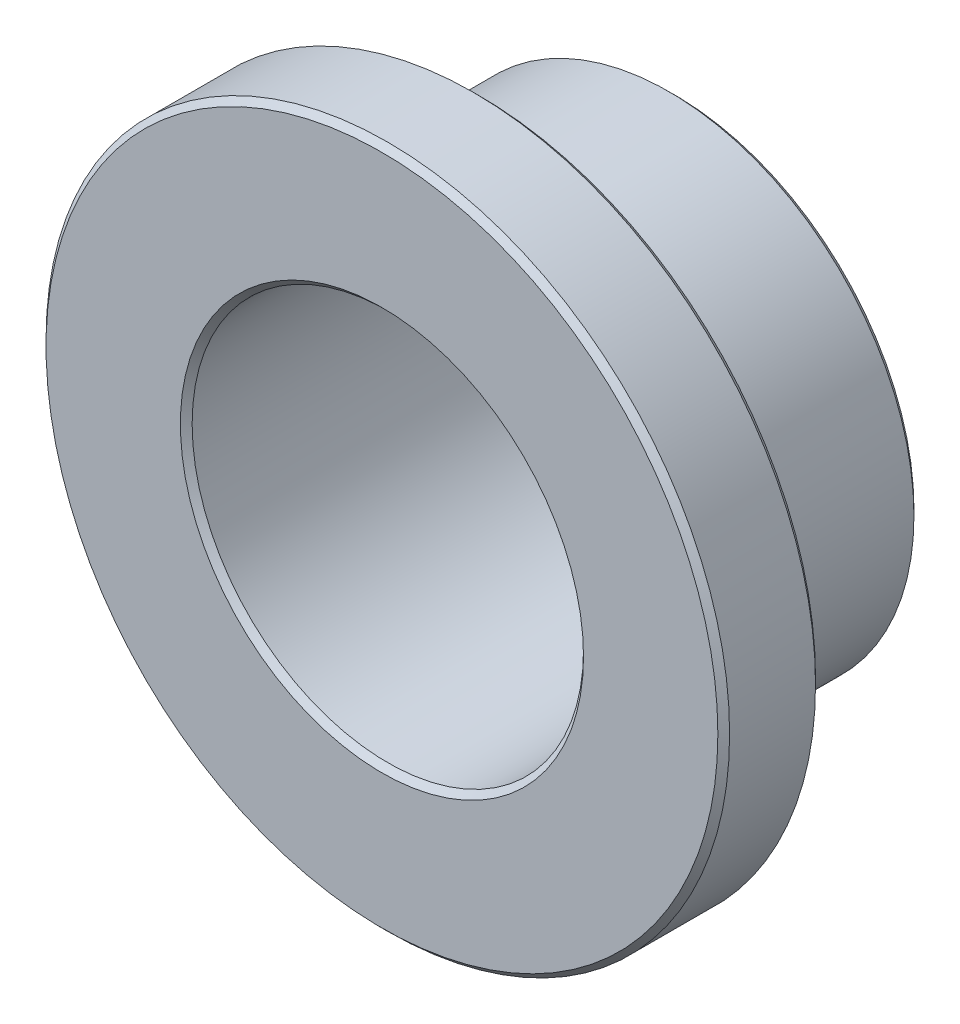
ISO-10303-21;
HEADER;
FILE_DESCRIPTION(('STEP AP214'),'2;1');
FILE_NAME('part.step','',(''),(''),'','','');
FILE_SCHEMA(('AUTOMOTIVE_DESIGN { 1 0 10303 214 1 1 1 1 }'));
ENDSEC;
DATA;
#1=APPLICATION_CONTEXT('core data for automotive mechanical design processes');
#2=APPLICATION_PROTOCOL_DEFINITION('international standard','automotive_design',2000,#1);
#3=PRODUCT_CONTEXT('',#1,'mechanical');
#4=PRODUCT('Part','Part','',(#3));
#5=PRODUCT_RELATED_PRODUCT_CATEGORY('part','',(#4));
#6=PRODUCT_DEFINITION_FORMATION('','',#4);
#7=PRODUCT_DEFINITION_CONTEXT('part definition',#1,'design');
#8=PRODUCT_DEFINITION('design','',#6,#7);
#9=PRODUCT_DEFINITION_SHAPE('','',#8);
#10=(LENGTH_UNIT() NAMED_UNIT(*) SI_UNIT(.MILLI.,.METRE.));
#11=(NAMED_UNIT(*) PLANE_ANGLE_UNIT() SI_UNIT($,.RADIAN.));
#12=(NAMED_UNIT(*) SI_UNIT($,.STERADIAN.) SOLID_ANGLE_UNIT());
#13=UNCERTAINTY_MEASURE_WITH_UNIT(LENGTH_MEASURE(1.E-05),#10,'distance_accuracy_value','');
#14=(GEOMETRIC_REPRESENTATION_CONTEXT(3) GLOBAL_UNCERTAINTY_ASSIGNED_CONTEXT((#13)) GLOBAL_UNIT_ASSIGNED_CONTEXT((#10,
#11,#12)) REPRESENTATION_CONTEXT('',''));
#15=CARTESIAN_POINT('',(0.,0.,0.));
#16=DIRECTION('',(0.,0.,1.));
#17=DIRECTION('',(1.,0.,0.));
#18=AXIS2_PLACEMENT_3D('',#15,#16,#17);
#19=CARTESIAN_POINT('',(0.,0.,1.5875));
#20=DIRECTION('',(0.,0.,1.));
#21=DIRECTION('',(1.,0.,0.));
#22=AXIS2_PLACEMENT_3D('',#19,#20,#21);
#23=CYLINDRICAL_SURFACE('',#22,11.1125);
#24=CARTESIAN_POINT('',(0.,0.,4.571619));
#25=DIRECTION('',(0.,0.,1.));
#26=DIRECTION('',(1.,0.,0.));
#27=AXIS2_PLACEMENT_3D('',#24,#25,#26);
#28=CIRCLE('',#27,11.1125);
#29=CARTESIAN_POINT('',(11.1125,0.,4.571619));
#30=VERTEX_POINT('',#29);
#31=EDGE_CURVE('E79',#30,#30,#28,.F.);
#32=ORIENTED_EDGE('',*,*,#31,.T.);
#33=EDGE_LOOP('',(#32));
#34=FACE_BOUND('',#33,.T.);
#35=CARTESIAN_POINT('',(0.,0.,1.778381));
#36=DIRECTION('',(0.,0.,1.));
#37=DIRECTION('',(1.,0.,0.));
#38=AXIS2_PLACEMENT_3D('',#35,#36,#37);
#39=CIRCLE('',#38,11.1125);
#40=CARTESIAN_POINT('',(11.1125,0.,1.778381));
#41=VERTEX_POINT('',#40);
#42=EDGE_CURVE('E83',#41,#41,#39,.T.);
#43=ORIENTED_EDGE('',*,*,#42,.T.);
#44=EDGE_LOOP('',(#43));
#45=FACE_BOUND('',#44,.T.);
#46=ADVANCED_FACE('F45',(#34,#45),#23,.T.);
#47=CARTESIAN_POINT('',(0.,0.,1.5875));
#48=DIRECTION('',(0.,0.,1.));
#49=DIRECTION('',(1.,0.,0.));
#50=AXIS2_PLACEMENT_3D('',#47,#48,#49);
#51=PLANE('',#50);
#52=CARTESIAN_POINT('',(0.,0.,1.5875));
#53=DIRECTION('',(0.,0.,1.));
#54=DIRECTION('',(1.,0.,0.));
#55=AXIS2_PLACEMENT_3D('',#52,#53,#54);
#56=CIRCLE('',#55,10.921619);
#57=CARTESIAN_POINT('',(10.921619,0.,1.5875));
#58=VERTEX_POINT('',#57);
#59=EDGE_CURVE('E71',#58,#58,#56,.F.);
#60=ORIENTED_EDGE('',*,*,#59,.T.);
#61=EDGE_LOOP('',(#60));
#62=FACE_BOUND('',#61,.T.);
#63=CARTESIAN_POINT('',(0.,0.,1.5875));
#64=DIRECTION('',(0.,0.,1.));
#65=DIRECTION('',(1.,0.,0.));
#66=AXIS2_PLACEMENT_3D('',#63,#64,#65);
#67=CIRCLE('',#66,8.153781);
#68=CARTESIAN_POINT('',(8.153781,0.,1.5875));
#69=VERTEX_POINT('',#68);
#70=EDGE_CURVE('E75',#69,#69,#67,.T.);
#71=ORIENTED_EDGE('',*,*,#70,.T.);
#72=EDGE_LOOP('',(#71));
#73=FACE_BOUND('',#72,.T.);
#74=ADVANCED_FACE('F120',(#62,#73),#51,.F.);
#75=CARTESIAN_POINT('',(0.,0.,4.7625));
#76=DIRECTION('',(0.,0.,1.));
#77=DIRECTION('',(1.,0.,0.));
#78=AXIS2_PLACEMENT_3D('',#75,#76,#77);
#79=PLANE('',#78);
#80=CARTESIAN_POINT('',(0.,0.,4.7625));
#81=DIRECTION('',(0.,0.,1.));
#82=DIRECTION('',(1.,0.,0.));
#83=AXIS2_PLACEMENT_3D('',#80,#81,#82);
#84=CIRCLE('',#83,6.55358100000001);
#85=CARTESIAN_POINT('',(6.55358100000001,0.,4.7625));
#86=VERTEX_POINT('',#85);
#87=EDGE_CURVE('E87',#86,#86,#84,.F.);
#88=ORIENTED_EDGE('',*,*,#87,.T.);
#89=EDGE_LOOP('',(#88));
#90=FACE_BOUND('',#89,.T.);
#91=CARTESIAN_POINT('',(0.,0.,4.7625));
#92=DIRECTION('',(0.,0.,1.));
#93=DIRECTION('',(1.,0.,0.));
#94=AXIS2_PLACEMENT_3D('',#91,#92,#93);
#95=CIRCLE('',#94,10.921619);
#96=CARTESIAN_POINT('',(10.921619,0.,4.7625));
#97=VERTEX_POINT('',#96);
#98=EDGE_CURVE('E91',#97,#97,#95,.T.);
#99=ORIENTED_EDGE('',*,*,#98,.T.);
#100=EDGE_LOOP('',(#99));
#101=FACE_BOUND('',#100,.T.);
#102=ADVANCED_FACE('F126',(#90,#101),#79,.T.);
#103=CARTESIAN_POINT('',(0.,0.,1.5875));
#104=DIRECTION('',(0.,0.,1.));
#105=DIRECTION('',(1.,0.,0.));
#106=AXIS2_PLACEMENT_3D('',#103,#104,#105);
#107=CYLINDRICAL_SURFACE('',#106,6.3627);
#108=CARTESIAN_POINT('',(0.,0.,4.571619));
#109=DIRECTION('',(0.,0.,1.));
#110=DIRECTION('',(1.,0.,0.));
#111=AXIS2_PLACEMENT_3D('',#108,#109,#110);
#112=CIRCLE('',#111,6.3627);
#113=CARTESIAN_POINT('',(6.3627,0.,4.571619));
#114=VERTEX_POINT('',#113);
#115=EDGE_CURVE('E95',#114,#114,#112,.T.);
#116=ORIENTED_EDGE('',*,*,#115,.T.);
#117=EDGE_LOOP('',(#116));
#118=FACE_BOUND('',#117,.T.);
#119=CARTESIAN_POINT('',(0.,0.,-4.571619));
#120=DIRECTION('',(0.,0.,1.));
#121=DIRECTION('',(1.,0.,0.));
#122=AXIS2_PLACEMENT_3D('',#119,#120,#121);
#123=CIRCLE('',#122,6.3627);
#124=CARTESIAN_POINT('',(6.3627,0.,-4.571619));
#125=VERTEX_POINT('',#124);
#126=EDGE_CURVE('E99',#125,#125,#123,.F.);
#127=ORIENTED_EDGE('',*,*,#126,.T.);
#128=EDGE_LOOP('',(#127));
#129=FACE_BOUND('',#128,.T.);
#130=ADVANCED_FACE('F105',(#118,#129),#107,.F.);
#131=CARTESIAN_POINT('',(0.,0.,-4.7625));
#132=DIRECTION('',(0.,0.,1.));
#133=DIRECTION('',(1.,0.,0.));
#134=AXIS2_PLACEMENT_3D('',#131,#132,#133);
#135=CYLINDRICAL_SURFACE('',#134,7.9629);
#136=CARTESIAN_POINT('',(0.,0.,1.396619));
#137=DIRECTION('',(0.,0.,1.));
#138=DIRECTION('',(1.,0.,0.));
#139=AXIS2_PLACEMENT_3D('',#136,#137,#138);
#140=CIRCLE('',#139,7.9629);
#141=CARTESIAN_POINT('',(7.9629,0.,1.396619));
#142=VERTEX_POINT('',#141);
#143=EDGE_CURVE('E59',#142,#142,#140,.F.);
#144=ORIENTED_EDGE('',*,*,#143,.T.);
#145=EDGE_LOOP('',(#144));
#146=FACE_BOUND('',#145,.T.);
#147=CARTESIAN_POINT('',(0.,0.,-4.571619));
#148=DIRECTION('',(0.,0.,1.));
#149=DIRECTION('',(1.,0.,0.));
#150=AXIS2_PLACEMENT_3D('',#147,#148,#149);
#151=CIRCLE('',#150,7.9629);
#152=CARTESIAN_POINT('',(7.9629,0.,-4.571619));
#153=VERTEX_POINT('',#152);
#154=EDGE_CURVE('E65',#153,#153,#151,.T.);
#155=ORIENTED_EDGE('',*,*,#154,.T.);
#156=EDGE_LOOP('',(#155));
#157=FACE_BOUND('',#156,.T.);
#158=ADVANCED_FACE('F188',(#146,#157),#135,.T.);
#159=CARTESIAN_POINT('',(0.,0.,-4.7625));
#160=DIRECTION('',(0.,0.,1.));
#161=DIRECTION('',(1.,0.,0.));
#162=AXIS2_PLACEMENT_3D('',#159,#160,#161);
#163=PLANE('',#162);
#164=CARTESIAN_POINT('',(0.,0.,-4.7625));
#165=DIRECTION('',(0.,0.,1.));
#166=DIRECTION('',(1.,0.,0.));
#167=AXIS2_PLACEMENT_3D('',#164,#165,#166);
#168=CIRCLE('',#167,6.55358099999999);
#169=CARTESIAN_POINT('',(6.55358099999999,0.,-4.7625));
#170=VERTEX_POINT('',#169);
#171=EDGE_CURVE('E10',#170,#170,#168,.T.);
#172=ORIENTED_EDGE('',*,*,#171,.T.);
#173=EDGE_LOOP('',(#172));
#174=FACE_BOUND('',#173,.T.);
#175=CARTESIAN_POINT('',(0.,0.,-4.7625));
#176=DIRECTION('',(0.,0.,1.));
#177=DIRECTION('',(1.,0.,0.));
#178=AXIS2_PLACEMENT_3D('',#175,#176,#177);
#179=CIRCLE('',#178,7.772019);
#180=CARTESIAN_POINT('',(7.772019,0.,-4.7625));
#181=VERTEX_POINT('',#180);
#182=EDGE_CURVE('E53',#181,#181,#179,.F.);
#183=ORIENTED_EDGE('',*,*,#182,.T.);
#184=EDGE_LOOP('',(#183));
#185=FACE_BOUND('',#184,.T.);
#186=ADVANCED_FACE('F136',(#174,#185),#163,.F.);
#187=CARTESIAN_POINT('',(0.,0.,4.571619));
#188=DIRECTION('',(0.,0.,1.));
#189=DIRECTION('',(1.,0.,0.));
#190=AXIS2_PLACEMENT_3D('',#187,#188,#189);
#191=CONICAL_SURFACE('',#190,6.3627,0.785398163397462);
#192=ORIENTED_EDGE('',*,*,#87,.F.);
#193=EDGE_LOOP('',(#192));
#194=FACE_BOUND('',#193,.T.);
#195=ORIENTED_EDGE('',*,*,#115,.F.);
#196=EDGE_LOOP('',(#195));
#197=FACE_BOUND('',#196,.T.);
#198=ADVANCED_FACE('F132',(#194,#197),#191,.F.);
#199=CARTESIAN_POINT('',(0.,0.,4.7625));
#200=DIRECTION('',(0.,0.,-1.));
#201=DIRECTION('',(-1.,0.,0.));
#202=AXIS2_PLACEMENT_3D('',#199,#200,#201);
#203=CONICAL_SURFACE('',#202,10.921619,0.785398163397457);
#204=ORIENTED_EDGE('',*,*,#31,.F.);
#205=EDGE_LOOP('',(#204));
#206=FACE_BOUND('',#205,.T.);
#207=ORIENTED_EDGE('',*,*,#98,.F.);
#208=EDGE_LOOP('',(#207));
#209=FACE_BOUND('',#208,.T.);
#210=ADVANCED_FACE('F135',(#206,#209),#203,.T.);
#211=CARTESIAN_POINT('',(0.,0.,1.778381));
#212=DIRECTION('',(0.,0.,1.));
#213=DIRECTION('',(1.,0.,0.));
#214=AXIS2_PLACEMENT_3D('',#211,#212,#213);
#215=CONICAL_SURFACE('',#214,11.1125,0.785398163397453);
#216=ORIENTED_EDGE('',*,*,#59,.F.);
#217=EDGE_LOOP('',(#216));
#218=FACE_BOUND('',#217,.T.);
#219=ORIENTED_EDGE('',*,*,#42,.F.);
#220=EDGE_LOOP('',(#219));
#221=FACE_BOUND('',#220,.T.);
#222=ADVANCED_FACE('F116',(#218,#221),#215,.T.);
#223=CARTESIAN_POINT('',(0.,0.,1.5875));
#224=DIRECTION('',(0.,0.,1.));
#225=DIRECTION('',(1.,0.,0.));
#226=AXIS2_PLACEMENT_3D('',#223,#224,#225);
#227=CONICAL_SURFACE('',#226,8.153781,0.785398163397453);
#228=ORIENTED_EDGE('',*,*,#143,.F.);
#229=EDGE_LOOP('',(#228));
#230=FACE_BOUND('',#229,.T.);
#231=ORIENTED_EDGE('',*,*,#70,.F.);
#232=EDGE_LOOP('',(#231));
#233=FACE_BOUND('',#232,.T.);
#234=ADVANCED_FACE('F110',(#230,#233),#227,.T.);
#235=CARTESIAN_POINT('',(0.,0.,-4.7625));
#236=DIRECTION('',(0.,0.,-1.));
#237=DIRECTION('',(-1.,0.,0.));
#238=AXIS2_PLACEMENT_3D('',#235,#236,#237);
#239=CONICAL_SURFACE('',#238,6.55358099999999,0.785398163397435);
#240=ORIENTED_EDGE('',*,*,#126,.F.);
#241=EDGE_LOOP('',(#240));
#242=FACE_BOUND('',#241,.T.);
#243=ORIENTED_EDGE('',*,*,#171,.F.);
#244=EDGE_LOOP('',(#243));
#245=FACE_BOUND('',#244,.T.);
#246=ADVANCED_FACE('F107',(#242,#245),#239,.F.);
#247=CARTESIAN_POINT('',(0.,0.,-4.571619));
#248=DIRECTION('',(0.,0.,1.));
#249=DIRECTION('',(1.,0.,0.));
#250=AXIS2_PLACEMENT_3D('',#247,#248,#249);
#251=CONICAL_SURFACE('',#250,7.9629,0.785398163397462);
#252=ORIENTED_EDGE('',*,*,#182,.F.);
#253=EDGE_LOOP('',(#252));
#254=FACE_BOUND('',#253,.T.);
#255=ORIENTED_EDGE('',*,*,#154,.F.);
#256=EDGE_LOOP('',(#255));
#257=FACE_BOUND('',#256,.T.);
#258=ADVANCED_FACE('F47',(#254,#257),#251,.T.);
#259=CLOSED_SHELL('',(#46,#74,#102,#130,#158,#186,#198,#210,#222,#234,#246,#258));
#260=MANIFOLD_SOLID_BREP('B2',#259);
#261=ADVANCED_BREP_SHAPE_REPRESENTATION('',(#18,#260),#14);
#262=SHAPE_DEFINITION_REPRESENTATION(#9,#261);
ENDSEC;
END-ISO-10303-21;
